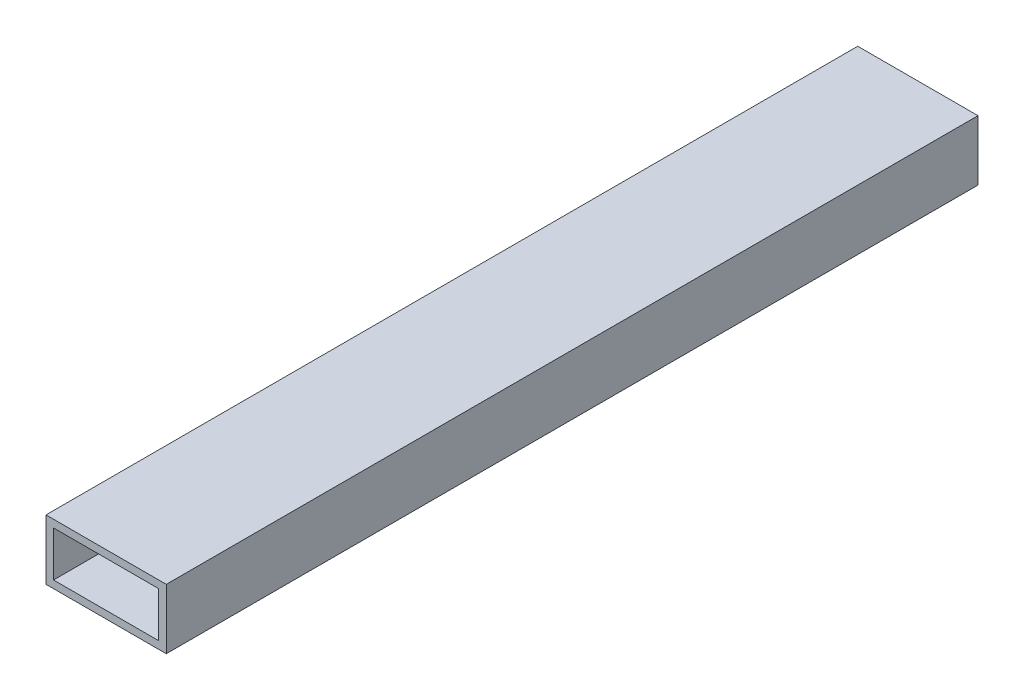
ISO-10303-21;
HEADER;
FILE_DESCRIPTION(('STEP AP214'),'2;1');
FILE_NAME('part.step','',(''),(''),'','','');
FILE_SCHEMA(('AUTOMOTIVE_DESIGN { 1 0 10303 214 1 1 1 1 }'));
ENDSEC;
DATA;
#1=APPLICATION_CONTEXT('core data for automotive mechanical design processes');
#2=APPLICATION_PROTOCOL_DEFINITION('international standard','automotive_design',2000,#1);
#3=PRODUCT_CONTEXT('',#1,'mechanical');
#4=PRODUCT('Part','Part','',(#3));
#5=PRODUCT_RELATED_PRODUCT_CATEGORY('part','',(#4));
#6=PRODUCT_DEFINITION_FORMATION('','',#4);
#7=PRODUCT_DEFINITION_CONTEXT('part definition',#1,'design');
#8=PRODUCT_DEFINITION('design','',#6,#7);
#9=PRODUCT_DEFINITION_SHAPE('','',#8);
#10=(LENGTH_UNIT() NAMED_UNIT(*) SI_UNIT(.MILLI.,.METRE.));
#11=(NAMED_UNIT(*) PLANE_ANGLE_UNIT() SI_UNIT($,.RADIAN.));
#12=(NAMED_UNIT(*) SI_UNIT($,.STERADIAN.) SOLID_ANGLE_UNIT());
#13=UNCERTAINTY_MEASURE_WITH_UNIT(LENGTH_MEASURE(1.E-05),#10,'distance_accuracy_value','');
#14=(GEOMETRIC_REPRESENTATION_CONTEXT(3) GLOBAL_UNCERTAINTY_ASSIGNED_CONTEXT((#13)) GLOBAL_UNIT_ASSIGNED_CONTEXT((#10,
#11,#12)) REPRESENTATION_CONTEXT('',''));
#15=CARTESIAN_POINT('',(0.,0.,0.));
#16=DIRECTION('',(0.,0.,1.));
#17=DIRECTION('',(1.,0.,0.));
#18=AXIS2_PLACEMENT_3D('',#15,#16,#17);
#19=CARTESIAN_POINT('',(22.225,9.525,0.));
#20=DIRECTION('',(1.,0.,0.));
#21=DIRECTION('',(0.,0.,-1.));
#22=AXIS2_PLACEMENT_3D('',#19,#20,#21);
#23=PLANE('',#22);
#24=DIRECTION('',(0.,-1.,0.));
#25=VECTOR('',#24,1.);
#26=CARTESIAN_POINT('',(22.225,4.7625,171.45));
#27=LINE('',#26,#25);
#28=CARTESIAN_POINT('',(22.225,9.525,171.45));
#29=VERTEX_POINT('',#28);
#30=CARTESIAN_POINT('',(22.225,-9.525,171.45));
#31=VERTEX_POINT('',#30);
#32=EDGE_CURVE('E34',#29,#31,#27,.T.);
#33=ORIENTED_EDGE('',*,*,#32,.F.);
#34=DIRECTION('',(0.,0.,-1.));
#35=VECTOR('',#34,1.);
#36=CARTESIAN_POINT('',(22.225,9.525,0.));
#37=LINE('',#36,#35);
#38=CARTESIAN_POINT('',(22.225,9.525,-171.45));
#39=VERTEX_POINT('',#38);
#40=EDGE_CURVE('E10',#29,#39,#37,.T.);
#41=ORIENTED_EDGE('',*,*,#40,.T.);
#42=DIRECTION('',(0.,1.,0.));
#43=VECTOR('',#42,1.);
#44=CARTESIAN_POINT('',(22.225,4.7625,-171.45));
#45=LINE('',#44,#43);
#46=CARTESIAN_POINT('',(22.225,-9.525,-171.45));
#47=VERTEX_POINT('',#46);
#48=EDGE_CURVE('E175',#47,#39,#45,.T.);
#49=ORIENTED_EDGE('',*,*,#48,.F.);
#50=DIRECTION('',(0.,0.,1.));
#51=VECTOR('',#50,1.);
#52=CARTESIAN_POINT('',(22.225,-9.525,0.));
#53=LINE('',#52,#51);
#54=EDGE_CURVE('E26',#47,#31,#53,.T.);
#55=ORIENTED_EDGE('',*,*,#54,.T.);
#56=EDGE_LOOP('',(#33,#41,#49,#55));
#57=FACE_BOUND('',#56,.T.);
#58=ADVANCED_FACE('F16',(#57),#23,.F.);
#59=CARTESIAN_POINT('',(22.225,-9.525,0.));
#60=DIRECTION('',(0.,-1.,0.));
#61=DIRECTION('',(0.,0.,-1.));
#62=AXIS2_PLACEMENT_3D('',#59,#60,#61);
#63=PLANE('',#62);
#64=DIRECTION('',(-1.,0.,0.));
#65=VECTOR('',#64,1.);
#66=CARTESIAN_POINT('',(11.1125,-9.525,171.45));
#67=LINE('',#66,#65);
#68=CARTESIAN_POINT('',(-22.225,-9.525,171.45));
#69=VERTEX_POINT('',#68);
#70=EDGE_CURVE('E166',#31,#69,#67,.T.);
#71=ORIENTED_EDGE('',*,*,#70,.F.);
#72=ORIENTED_EDGE('',*,*,#54,.F.);
#73=DIRECTION('',(1.,0.,0.));
#74=VECTOR('',#73,1.);
#75=CARTESIAN_POINT('',(11.1125,-9.525,-171.45));
#76=LINE('',#75,#74);
#77=CARTESIAN_POINT('',(-22.225,-9.525,-171.45));
#78=VERTEX_POINT('',#77);
#79=EDGE_CURVE('E117',#78,#47,#76,.T.);
#80=ORIENTED_EDGE('',*,*,#79,.F.);
#81=DIRECTION('',(0.,0.,1.));
#82=VECTOR('',#81,1.);
#83=CARTESIAN_POINT('',(-22.225,-9.525,0.));
#84=LINE('',#83,#82);
#85=EDGE_CURVE('E159',#78,#69,#84,.T.);
#86=ORIENTED_EDGE('',*,*,#85,.T.);
#87=EDGE_LOOP('',(#71,#72,#80,#86));
#88=FACE_BOUND('',#87,.T.);
#89=ADVANCED_FACE('F142',(#88),#63,.F.);
#90=CARTESIAN_POINT('',(-22.225,-9.525,0.));
#91=DIRECTION('',(-1.,0.,0.));
#92=DIRECTION('',(0.,0.,1.));
#93=AXIS2_PLACEMENT_3D('',#90,#91,#92);
#94=PLANE('',#93);
#95=DIRECTION('',(0.,1.,0.));
#96=VECTOR('',#95,1.);
#97=CARTESIAN_POINT('',(-22.225,-4.7625,171.45));
#98=LINE('',#97,#96);
#99=CARTESIAN_POINT('',(-22.225,9.525,171.45));
#100=VERTEX_POINT('',#99);
#101=EDGE_CURVE('E157',#69,#100,#98,.T.);
#102=ORIENTED_EDGE('',*,*,#101,.F.);
#103=ORIENTED_EDGE('',*,*,#85,.F.);
#104=DIRECTION('',(0.,-1.,0.));
#105=VECTOR('',#104,1.);
#106=CARTESIAN_POINT('',(-22.225,-4.7625,-171.45));
#107=LINE('',#106,#105);
#108=CARTESIAN_POINT('',(-22.225,9.525,-171.45));
#109=VERTEX_POINT('',#108);
#110=EDGE_CURVE('E121',#109,#78,#107,.T.);
#111=ORIENTED_EDGE('',*,*,#110,.F.);
#112=DIRECTION('',(0.,0.,1.));
#113=VECTOR('',#112,1.);
#114=CARTESIAN_POINT('',(-22.225,9.525,0.));
#115=LINE('',#114,#113);
#116=EDGE_CURVE('E162',#109,#100,#115,.T.);
#117=ORIENTED_EDGE('',*,*,#116,.T.);
#118=EDGE_LOOP('',(#102,#103,#111,#117));
#119=FACE_BOUND('',#118,.T.);
#120=ADVANCED_FACE('F138',(#119),#94,.F.);
#121=CARTESIAN_POINT('',(-22.225,9.525,0.));
#122=DIRECTION('',(0.,1.,0.));
#123=DIRECTION('',(0.,0.,1.));
#124=AXIS2_PLACEMENT_3D('',#121,#122,#123);
#125=PLANE('',#124);
#126=DIRECTION('',(1.,0.,0.));
#127=VECTOR('',#126,1.);
#128=CARTESIAN_POINT('',(-11.1125,9.525,171.45));
#129=LINE('',#128,#127);
#130=EDGE_CURVE('E167',#100,#29,#129,.T.);
#131=ORIENTED_EDGE('',*,*,#130,.F.);
#132=ORIENTED_EDGE('',*,*,#116,.F.);
#133=DIRECTION('',(-1.,0.,0.));
#134=VECTOR('',#133,1.);
#135=CARTESIAN_POINT('',(-11.1125,9.525,-171.45));
#136=LINE('',#135,#134);
#137=EDGE_CURVE('E174',#39,#109,#136,.T.);
#138=ORIENTED_EDGE('',*,*,#137,.F.);
#139=ORIENTED_EDGE('',*,*,#40,.F.);
#140=EDGE_LOOP('',(#131,#132,#138,#139));
#141=FACE_BOUND('',#140,.T.);
#142=ADVANCED_FACE('F128',(#141),#125,.F.);
#143=CARTESIAN_POINT('',(0.,0.,-171.45));
#144=DIRECTION('',(0.,0.,1.));
#145=DIRECTION('',(1.,0.,0.));
#146=AXIS2_PLACEMENT_3D('',#143,#144,#145);
#147=PLANE('',#146);
#148=ORIENTED_EDGE('',*,*,#48,.T.);
#149=ORIENTED_EDGE('',*,*,#137,.T.);
#150=ORIENTED_EDGE('',*,*,#110,.T.);
#151=ORIENTED_EDGE('',*,*,#79,.T.);
#152=EDGE_LOOP('',(#148,#149,#150,#151));
#153=FACE_BOUND('',#152,.T.);
#154=DIRECTION('',(0.,-1.,0.));
#155=VECTOR('',#154,1.);
#156=CARTESIAN_POINT('',(-25.4,-12.7,-171.45));
#157=LINE('',#156,#155);
#158=CARTESIAN_POINT('',(-25.4,12.7,-171.45));
#159=VERTEX_POINT('',#158);
#160=CARTESIAN_POINT('',(-25.4,-12.7,-171.45));
#161=VERTEX_POINT('',#160);
#162=EDGE_CURVE('E96',#159,#161,#157,.T.);
#163=ORIENTED_EDGE('',*,*,#162,.F.);
#164=DIRECTION('',(-1.,0.,0.));
#165=VECTOR('',#164,1.);
#166=CARTESIAN_POINT('',(-25.4,12.7,-171.45));
#167=LINE('',#166,#165);
#168=CARTESIAN_POINT('',(25.4,12.7,-171.45));
#169=VERTEX_POINT('',#168);
#170=EDGE_CURVE('E88',#169,#159,#167,.T.);
#171=ORIENTED_EDGE('',*,*,#170,.F.);
#172=DIRECTION('',(0.,1.,0.));
#173=VECTOR('',#172,1.);
#174=CARTESIAN_POINT('',(25.4,12.7,-171.45));
#175=LINE('',#174,#173);
#176=CARTESIAN_POINT('',(25.4,-12.7,-171.45));
#177=VERTEX_POINT('',#176);
#178=EDGE_CURVE('E111',#177,#169,#175,.T.);
#179=ORIENTED_EDGE('',*,*,#178,.F.);
#180=DIRECTION('',(1.,0.,0.));
#181=VECTOR('',#180,1.);
#182=CARTESIAN_POINT('',(25.4,-12.7,-171.45));
#183=LINE('',#182,#181);
#184=EDGE_CURVE('E95',#161,#177,#183,.T.);
#185=ORIENTED_EDGE('',*,*,#184,.F.);
#186=EDGE_LOOP('',(#163,#171,#179,#185));
#187=FACE_BOUND('',#186,.T.);
#188=ADVANCED_FACE('F126',(#153,#187),#147,.F.);
#189=CARTESIAN_POINT('',(25.4,12.7,0.));
#190=DIRECTION('',(1.,0.,0.));
#191=DIRECTION('',(0.,0.,-1.));
#192=AXIS2_PLACEMENT_3D('',#189,#190,#191);
#193=PLANE('',#192);
#194=DIRECTION('',(0.,-1.,0.));
#195=VECTOR('',#194,1.);
#196=CARTESIAN_POINT('',(25.4,12.7,171.45));
#197=LINE('',#196,#195);
#198=CARTESIAN_POINT('',(25.4,12.7,171.45));
#199=VERTEX_POINT('',#198);
#200=CARTESIAN_POINT('',(25.4,-12.7,171.45));
#201=VERTEX_POINT('',#200);
#202=EDGE_CURVE('E100',#199,#201,#197,.T.);
#203=ORIENTED_EDGE('',*,*,#202,.T.);
#204=DIRECTION('',(0.,0.,-1.));
#205=VECTOR('',#204,1.);
#206=CARTESIAN_POINT('',(25.4,-12.7,0.));
#207=LINE('',#206,#205);
#208=EDGE_CURVE('E107',#201,#177,#207,.T.);
#209=ORIENTED_EDGE('',*,*,#208,.T.);
#210=ORIENTED_EDGE('',*,*,#178,.T.);
#211=DIRECTION('',(0.,0.,-1.));
#212=VECTOR('',#211,1.);
#213=CARTESIAN_POINT('',(25.4,12.7,0.));
#214=LINE('',#213,#212);
#215=EDGE_CURVE('E101',#199,#169,#214,.T.);
#216=ORIENTED_EDGE('',*,*,#215,.F.);
#217=EDGE_LOOP('',(#203,#209,#210,#216));
#218=FACE_BOUND('',#217,.T.);
#219=ADVANCED_FACE('F124',(#218),#193,.T.);
#220=CARTESIAN_POINT('',(25.4,-12.7,0.));
#221=DIRECTION('',(0.,-1.,0.));
#222=DIRECTION('',(0.,0.,-1.));
#223=AXIS2_PLACEMENT_3D('',#220,#221,#222);
#224=PLANE('',#223);
#225=DIRECTION('',(-1.,0.,0.));
#226=VECTOR('',#225,1.);
#227=CARTESIAN_POINT('',(25.4,-12.7,171.45));
#228=LINE('',#227,#226);
#229=CARTESIAN_POINT('',(-25.4,-12.7,171.45));
#230=VERTEX_POINT('',#229);
#231=EDGE_CURVE('E109',#201,#230,#228,.T.);
#232=ORIENTED_EDGE('',*,*,#231,.T.);
#233=DIRECTION('',(0.,0.,-1.));
#234=VECTOR('',#233,1.);
#235=CARTESIAN_POINT('',(-25.4,-12.7,0.));
#236=LINE('',#235,#234);
#237=EDGE_CURVE('E78',#230,#161,#236,.T.);
#238=ORIENTED_EDGE('',*,*,#237,.T.);
#239=ORIENTED_EDGE('',*,*,#184,.T.);
#240=ORIENTED_EDGE('',*,*,#208,.F.);
#241=EDGE_LOOP('',(#232,#238,#239,#240));
#242=FACE_BOUND('',#241,.T.);
#243=ADVANCED_FACE('F136',(#242),#224,.T.);
#244=CARTESIAN_POINT('',(-25.4,-12.7,0.));
#245=DIRECTION('',(-1.,0.,0.));
#246=DIRECTION('',(0.,0.,1.));
#247=AXIS2_PLACEMENT_3D('',#244,#245,#246);
#248=PLANE('',#247);
#249=DIRECTION('',(0.,1.,0.));
#250=VECTOR('',#249,1.);
#251=CARTESIAN_POINT('',(-25.4,-12.7,171.45));
#252=LINE('',#251,#250);
#253=CARTESIAN_POINT('',(-25.4,12.7,171.45));
#254=VERTEX_POINT('',#253);
#255=EDGE_CURVE('E91',#230,#254,#252,.T.);
#256=ORIENTED_EDGE('',*,*,#255,.T.);
#257=DIRECTION('',(0.,0.,1.));
#258=VECTOR('',#257,1.);
#259=CARTESIAN_POINT('',(-25.4,12.7,0.));
#260=LINE('',#259,#258);
#261=EDGE_CURVE('E84',#159,#254,#260,.T.);
#262=ORIENTED_EDGE('',*,*,#261,.F.);
#263=ORIENTED_EDGE('',*,*,#162,.T.);
#264=ORIENTED_EDGE('',*,*,#237,.F.);
#265=EDGE_LOOP('',(#256,#262,#263,#264));
#266=FACE_BOUND('',#265,.T.);
#267=ADVANCED_FACE('F92',(#266),#248,.T.);
#268=CARTESIAN_POINT('',(-25.4,12.7,0.));
#269=DIRECTION('',(0.,1.,0.));
#270=DIRECTION('',(0.,0.,1.));
#271=AXIS2_PLACEMENT_3D('',#268,#269,#270);
#272=PLANE('',#271);
#273=DIRECTION('',(1.,0.,0.));
#274=VECTOR('',#273,1.);
#275=CARTESIAN_POINT('',(-25.4,12.7,171.45));
#276=LINE('',#275,#274);
#277=EDGE_CURVE('E20',#254,#199,#276,.T.);
#278=ORIENTED_EDGE('',*,*,#277,.T.);
#279=ORIENTED_EDGE('',*,*,#215,.T.);
#280=ORIENTED_EDGE('',*,*,#170,.T.);
#281=ORIENTED_EDGE('',*,*,#261,.T.);
#282=EDGE_LOOP('',(#278,#279,#280,#281));
#283=FACE_BOUND('',#282,.T.);
#284=ADVANCED_FACE('F85',(#283),#272,.T.);
#285=CARTESIAN_POINT('',(0.,0.,171.45));
#286=DIRECTION('',(0.,0.,1.));
#287=DIRECTION('',(1.,0.,0.));
#288=AXIS2_PLACEMENT_3D('',#285,#286,#287);
#289=PLANE('',#288);
#290=ORIENTED_EDGE('',*,*,#32,.T.);
#291=ORIENTED_EDGE('',*,*,#70,.T.);
#292=ORIENTED_EDGE('',*,*,#101,.T.);
#293=ORIENTED_EDGE('',*,*,#130,.T.);
#294=EDGE_LOOP('',(#290,#291,#292,#293));
#295=FACE_BOUND('',#294,.T.);
#296=ORIENTED_EDGE('',*,*,#202,.F.);
#297=ORIENTED_EDGE('',*,*,#277,.F.);
#298=ORIENTED_EDGE('',*,*,#255,.F.);
#299=ORIENTED_EDGE('',*,*,#231,.F.);
#300=EDGE_LOOP('',(#296,#297,#298,#299));
#301=FACE_BOUND('',#300,.T.);
#302=ADVANCED_FACE('F18',(#295,#301),#289,.T.);
#303=CLOSED_SHELL('',(#58,#89,#120,#142,#188,#219,#243,#267,#284,#302));
#304=MANIFOLD_SOLID_BREP('B1',#303);
#305=ADVANCED_BREP_SHAPE_REPRESENTATION('',(#18,#304),#14);
#306=SHAPE_DEFINITION_REPRESENTATION(#9,#305);
ENDSEC;
END-ISO-10303-21;
